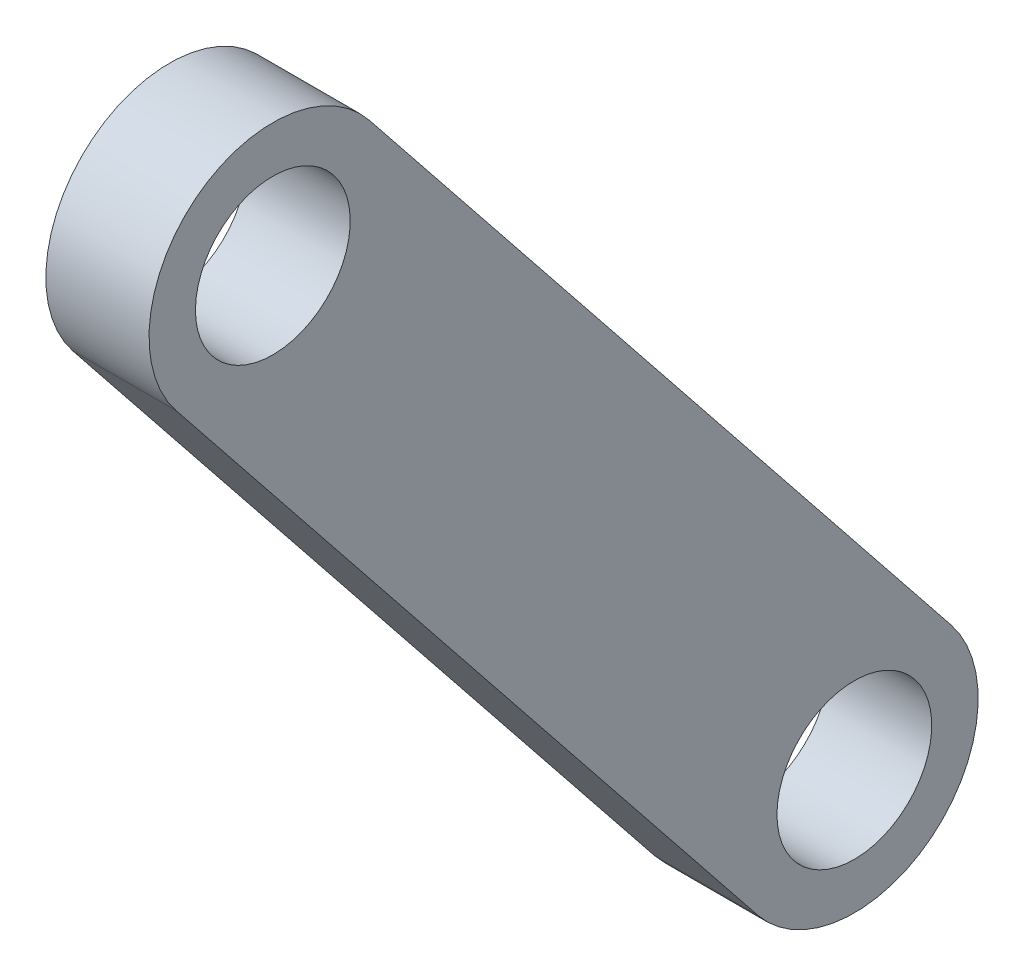
ISO-10303-21;
HEADER;
FILE_DESCRIPTION(('STEP AP214'),'2;1');
FILE_NAME('part.step','',(''),(''),'','','');
FILE_SCHEMA(('AUTOMOTIVE_DESIGN { 1 0 10303 214 1 1 1 1 }'));
ENDSEC;
DATA;
#1=APPLICATION_CONTEXT('core data for automotive mechanical design processes');
#2=APPLICATION_PROTOCOL_DEFINITION('international standard','automotive_design',2000,#1);
#3=PRODUCT_CONTEXT('',#1,'mechanical');
#4=PRODUCT('Part','Part','',(#3));
#5=PRODUCT_RELATED_PRODUCT_CATEGORY('part','',(#4));
#6=PRODUCT_DEFINITION_FORMATION('','',#4);
#7=PRODUCT_DEFINITION_CONTEXT('part definition',#1,'design');
#8=PRODUCT_DEFINITION('design','',#6,#7);
#9=PRODUCT_DEFINITION_SHAPE('','',#8);
#10=(LENGTH_UNIT() NAMED_UNIT(*) SI_UNIT(.MILLI.,.METRE.));
#11=(NAMED_UNIT(*) PLANE_ANGLE_UNIT() SI_UNIT($,.RADIAN.));
#12=(NAMED_UNIT(*) SI_UNIT($,.STERADIAN.) SOLID_ANGLE_UNIT());
#13=UNCERTAINTY_MEASURE_WITH_UNIT(LENGTH_MEASURE(1.E-05),#10,'distance_accuracy_value','');
#14=(GEOMETRIC_REPRESENTATION_CONTEXT(3) GLOBAL_UNCERTAINTY_ASSIGNED_CONTEXT((#13)) GLOBAL_UNIT_ASSIGNED_CONTEXT((#10,
#11,#12)) REPRESENTATION_CONTEXT('',''));
#15=CARTESIAN_POINT('',(0.,0.,0.));
#16=DIRECTION('',(0.,0.,1.));
#17=DIRECTION('',(1.,0.,0.));
#18=AXIS2_PLACEMENT_3D('',#15,#16,#17);
#19=CARTESIAN_POINT('',(2199.99999999987,5550.11623000931,-4431.25255969027));
#20=DIRECTION('',(1.,0.,0.));
#21=DIRECTION('',(0.,0.586791313624978,0.809738201059005));
#22=AXIS2_PLACEMENT_3D('',#19,#20,#21);
#23=PLANE('',#22);
#24=DIRECTION('',(0.,-0.781191492489702,-0.624291480048952));
#25=VECTOR('',#24,1.);
#26=CARTESIAN_POINT('',(2199.99999999987,5475.20125240349,-4337.50958059147));
#27=LINE('',#26,#25);
#28=CARTESIAN_POINT('',(2199.99999999987,5475.20125240346,-4337.50958059149));
#29=VERTEX_POINT('',#28);
#30=CARTESIAN_POINT('',(2199.99999999987,4769.94531848226,-4901.11693555354));
#31=VERTEX_POINT('',#30);
#32=EDGE_CURVE('E68',#29,#31,#27,.T.);
#33=ORIENTED_EDGE('',*,*,#32,.F.);
#34=CARTESIAN_POINT('',(2199.99999999987,5550.11623000931,-4431.25255969027));
#35=DIRECTION('',(1.,0.,0.));
#36=DIRECTION('',(0.,0.586791313624978,0.809738201059005));
#37=AXIS2_PLACEMENT_3D('',#34,#35,#36);
#38=CIRCLE('',#37,120.);
#39=CARTESIAN_POINT('',(2199.99999999987,5625.03120761519,-4524.99553878904));
#40=VERTEX_POINT('',#39);
#41=EDGE_CURVE('E59',#40,#29,#38,.T.);
#42=ORIENTED_EDGE('',*,*,#41,.F.);
#43=DIRECTION('',(0.,-0.781191492489703,-0.624291480048952));
#44=VECTOR('',#43,1.);
#45=CARTESIAN_POINT('',(2199.99999999987,5625.03120761519,-4524.99553878904));
#46=LINE('',#45,#44);
#47=CARTESIAN_POINT('',(2199.99999999987,4919.775273694,-5088.60289375107));
#48=VERTEX_POINT('',#47);
#49=EDGE_CURVE('E56',#40,#48,#46,.T.);
#50=ORIENTED_EDGE('',*,*,#49,.T.);
#51=CARTESIAN_POINT('',(2199.99999999987,4844.86029608813,-4994.8599146523));
#52=DIRECTION('',(1.,0.,0.));
#53=DIRECTION('',(0.,0.586791313624978,0.809738201059005));
#54=AXIS2_PLACEMENT_3D('',#51,#52,#53);
#55=CIRCLE('',#54,120.);
#56=EDGE_CURVE('E54',#31,#48,#55,.T.);
#57=ORIENTED_EDGE('',*,*,#56,.F.);
#58=EDGE_LOOP('',(#33,#42,#50,#57));
#59=FACE_BOUND('',#58,.T.);
#60=CARTESIAN_POINT('',(2199.99999999987,5550.11623000931,-4431.25255969027));
#61=DIRECTION('',(1.,0.,0.));
#62=DIRECTION('',(0.,0.586791313624978,0.809738201059005));
#63=AXIS2_PLACEMENT_3D('',#60,#61,#62);
#64=CIRCLE('',#63,75.0000000000001);
#65=CARTESIAN_POINT('',(2199.99999999987,5594.12557853119,-4370.52219461085));
#66=VERTEX_POINT('',#65);
#67=EDGE_CURVE('E78',#66,#66,#64,.T.);
#68=ORIENTED_EDGE('',*,*,#67,.T.);
#69=EDGE_LOOP('',(#68));
#70=FACE_BOUND('',#69,.T.);
#71=CARTESIAN_POINT('',(2199.99999999987,4844.86029608813,-4994.8599146523));
#72=DIRECTION('',(1.,0.,0.));
#73=DIRECTION('',(0.,0.586791313624978,0.809738201059005));
#74=AXIS2_PLACEMENT_3D('',#71,#72,#73);
#75=CIRCLE('',#74,75.0000000000072);
#76=CARTESIAN_POINT('',(2199.99999999987,4888.86964461001,-4934.12954957287));
#77=VERTEX_POINT('',#76);
#78=EDGE_CURVE('E19',#77,#77,#75,.T.);
#79=ORIENTED_EDGE('',*,*,#78,.T.);
#80=EDGE_LOOP('',(#79));
#81=FACE_BOUND('',#80,.T.);
#82=ADVANCED_FACE('F16',(#59,#70,#81),#23,.F.);
#83=CARTESIAN_POINT('',(2199.99999999987,4844.86029608813,-4994.8599146523));
#84=DIRECTION('',(1.,0.,0.));
#85=DIRECTION('',(0.,0.586791313624978,0.809738201059005));
#86=AXIS2_PLACEMENT_3D('',#83,#84,#85);
#87=CYLINDRICAL_SURFACE('',#86,75.0000000000072);
#88=CARTESIAN_POINT('',(2299.99999999987,4844.86029608813,-4994.8599146523));
#89=DIRECTION('',(1.,0.,0.));
#90=DIRECTION('',(0.,0.586791313624978,0.809738201059005));
#91=AXIS2_PLACEMENT_3D('',#88,#89,#90);
#92=CIRCLE('',#91,75.0000000000072);
#93=CARTESIAN_POINT('',(2299.99999999987,4888.86964461001,-4934.12954957287));
#94=VERTEX_POINT('',#93);
#95=EDGE_CURVE('E86',#94,#94,#92,.F.);
#96=ORIENTED_EDGE('',*,*,#95,.F.);
#97=EDGE_LOOP('',(#96));
#98=FACE_BOUND('',#97,.T.);
#99=ORIENTED_EDGE('',*,*,#78,.F.);
#100=EDGE_LOOP('',(#99));
#101=FACE_BOUND('',#100,.T.);
#102=ADVANCED_FACE('F96',(#98,#101),#87,.F.);
#103=CARTESIAN_POINT('',(2199.99999999987,5550.11623000931,-4431.25255969027));
#104=DIRECTION('',(1.,0.,0.));
#105=DIRECTION('',(0.,0.586791313624978,0.809738201059005));
#106=AXIS2_PLACEMENT_3D('',#103,#104,#105);
#107=CYLINDRICAL_SURFACE('',#106,75.0000000000001);
#108=CARTESIAN_POINT('',(2299.99999999987,5550.11623000931,-4431.25255969027));
#109=DIRECTION('',(1.,0.,0.));
#110=DIRECTION('',(0.,0.586791313624978,0.809738201059005));
#111=AXIS2_PLACEMENT_3D('',#108,#109,#110);
#112=CIRCLE('',#111,75.0000000000001);
#113=CARTESIAN_POINT('',(2299.99999999987,5594.12557853119,-4370.52219461085));
#114=VERTEX_POINT('',#113);
#115=EDGE_CURVE('E83',#114,#114,#112,.F.);
#116=ORIENTED_EDGE('',*,*,#115,.F.);
#117=EDGE_LOOP('',(#116));
#118=FACE_BOUND('',#117,.T.);
#119=ORIENTED_EDGE('',*,*,#67,.F.);
#120=EDGE_LOOP('',(#119));
#121=FACE_BOUND('',#120,.T.);
#122=ADVANCED_FACE('F98',(#118,#121),#107,.F.);
#123=CARTESIAN_POINT('',(2114.99999999987,-35.5179925257829,-8741.41708166616));
#124=DIRECTION('',(0.,-0.624291480048952,0.781191492489703));
#125=DIRECTION('',(0.000222778985371864,-0.78119147310425,-0.62429146455701));
#126=AXIS2_PLACEMENT_3D('',#123,#124,#125);
#127=PLANE('',#126);
#128=DIRECTION('',(0.,-0.781191492489702,-0.624291480048952));
#129=VECTOR('',#128,1.);
#130=CARTESIAN_POINT('',(2299.99999999987,5475.20125240344,-4337.50958059151));
#131=LINE('',#130,#129);
#132=CARTESIAN_POINT('',(2299.99999999987,5475.20125240346,-4337.50958059149));
#133=VERTEX_POINT('',#132);
#134=CARTESIAN_POINT('',(2299.99999999987,4769.94531848226,-4901.11693555354));
#135=VERTEX_POINT('',#134);
#136=EDGE_CURVE('E82',#133,#135,#131,.T.);
#137=ORIENTED_EDGE('',*,*,#136,.F.);
#138=DIRECTION('',(1.,0.,0.));
#139=VECTOR('',#138,1.);
#140=CARTESIAN_POINT('',(2114.99999999987,5475.20125240349,-4337.50958059147));
#141=LINE('',#140,#139);
#142=EDGE_CURVE('E89',#29,#133,#141,.T.);
#143=ORIENTED_EDGE('',*,*,#142,.F.);
#144=ORIENTED_EDGE('',*,*,#32,.T.);
#145=DIRECTION('',(1.,0.,0.));
#146=VECTOR('',#145,1.);
#147=CARTESIAN_POINT('',(2114.99999999987,4769.94531848226,-4901.11693555354));
#148=LINE('',#147,#146);
#149=EDGE_CURVE('E62',#135,#31,#148,.F.);
#150=ORIENTED_EDGE('',*,*,#149,.F.);
#151=EDGE_LOOP('',(#137,#143,#144,#150));
#152=FACE_BOUND('',#151,.T.);
#153=ADVANCED_FACE('F105',(#152),#127,.T.);
#154=CARTESIAN_POINT('',(2114.99999999987,4844.86029608813,-4994.8599146523));
#155=DIRECTION('',(1.,0.,0.));
#156=DIRECTION('',(0.,0.586791313624978,0.809738201059005));
#157=AXIS2_PLACEMENT_3D('',#154,#155,#156);
#158=CYLINDRICAL_SURFACE('',#157,120.);
#159=CARTESIAN_POINT('',(2299.99999999987,4844.86029608813,-4994.8599146523));
#160=DIRECTION('',(1.,0.,0.));
#161=DIRECTION('',(0.,0.586791313624978,0.809738201059005));
#162=AXIS2_PLACEMENT_3D('',#159,#160,#161);
#163=CIRCLE('',#162,120.);
#164=CARTESIAN_POINT('',(2299.99999999987,4919.775273694,-5088.60289375106));
#165=VERTEX_POINT('',#164);
#166=EDGE_CURVE('E80',#135,#165,#163,.T.);
#167=ORIENTED_EDGE('',*,*,#166,.F.);
#168=ORIENTED_EDGE('',*,*,#149,.T.);
#169=ORIENTED_EDGE('',*,*,#56,.T.);
#170=DIRECTION('',(1.,0.,0.));
#171=VECTOR('',#170,1.);
#172=CARTESIAN_POINT('',(2199.99999999987,4919.77527369401,-5088.60289375107));
#173=LINE('',#172,#171);
#174=EDGE_CURVE('E61',#48,#165,#173,.T.);
#175=ORIENTED_EDGE('',*,*,#174,.T.);
#176=EDGE_LOOP('',(#167,#168,#169,#175));
#177=FACE_BOUND('',#176,.T.);
#178=ADVANCED_FACE('F67',(#177),#158,.T.);
#179=CARTESIAN_POINT('',(2114.99999999987,114.311962685966,-8928.90303986369));
#180=DIRECTION('',(0.,-0.624291480048952,0.781191492489703));
#181=DIRECTION('',(0.000222778985371864,-0.781191473104249,-0.62429146455701));
#182=AXIS2_PLACEMENT_3D('',#179,#180,#181);
#183=PLANE('',#182);
#184=DIRECTION('',(0.,0.781191492489703,0.624291480048952));
#185=VECTOR('',#184,1.);
#186=CARTESIAN_POINT('',(2299.99999999987,4919.775273694,-5088.60289375106));
#187=LINE('',#186,#185);
#188=CARTESIAN_POINT('',(2299.99999999987,5625.03120761519,-4524.99553878903));
#189=VERTEX_POINT('',#188);
#190=EDGE_CURVE('E25',#165,#189,#187,.T.);
#191=ORIENTED_EDGE('',*,*,#190,.F.);
#192=ORIENTED_EDGE('',*,*,#174,.F.);
#193=ORIENTED_EDGE('',*,*,#49,.F.);
#194=DIRECTION('',(1.,0.,0.));
#195=VECTOR('',#194,1.);
#196=CARTESIAN_POINT('',(2114.99999999987,5625.03120761519,-4524.99553878903));
#197=LINE('',#196,#195);
#198=EDGE_CURVE('E34',#189,#40,#197,.F.);
#199=ORIENTED_EDGE('',*,*,#198,.F.);
#200=EDGE_LOOP('',(#191,#192,#193,#199));
#201=FACE_BOUND('',#200,.T.);
#202=ADVANCED_FACE('F70',(#201),#183,.F.);
#203=CARTESIAN_POINT('',(2114.99999999987,5550.11623000931,-4431.25255969027));
#204=DIRECTION('',(1.,0.,0.));
#205=DIRECTION('',(0.,0.586791313624978,0.809738201059005));
#206=AXIS2_PLACEMENT_3D('',#203,#204,#205);
#207=CYLINDRICAL_SURFACE('',#206,120.);
#208=ORIENTED_EDGE('',*,*,#142,.T.);
#209=CARTESIAN_POINT('',(2299.99999999987,5550.11623000931,-4431.25255969027));
#210=DIRECTION('',(1.,0.,0.));
#211=DIRECTION('',(0.,0.586791313624978,0.809738201059005));
#212=AXIS2_PLACEMENT_3D('',#209,#210,#211);
#213=CIRCLE('',#212,120.);
#214=EDGE_CURVE('E10',#189,#133,#213,.T.);
#215=ORIENTED_EDGE('',*,*,#214,.F.);
#216=ORIENTED_EDGE('',*,*,#198,.T.);
#217=ORIENTED_EDGE('',*,*,#41,.T.);
#218=EDGE_LOOP('',(#208,#215,#216,#217));
#219=FACE_BOUND('',#218,.T.);
#220=ADVANCED_FACE('F111',(#219),#207,.T.);
#221=CARTESIAN_POINT('',(2299.99999999987,5550.11623000931,-4431.25255969027));
#222=DIRECTION('',(1.,0.,0.));
#223=DIRECTION('',(0.,0.586791313624978,0.809738201059005));
#224=AXIS2_PLACEMENT_3D('',#221,#222,#223);
#225=PLANE('',#224);
#226=ORIENTED_EDGE('',*,*,#214,.T.);
#227=ORIENTED_EDGE('',*,*,#136,.T.);
#228=ORIENTED_EDGE('',*,*,#166,.T.);
#229=ORIENTED_EDGE('',*,*,#190,.T.);
#230=EDGE_LOOP('',(#226,#227,#228,#229));
#231=FACE_BOUND('',#230,.T.);
#232=ORIENTED_EDGE('',*,*,#115,.T.);
#233=EDGE_LOOP('',(#232));
#234=FACE_BOUND('',#233,.T.);
#235=ORIENTED_EDGE('',*,*,#95,.T.);
#236=EDGE_LOOP('',(#235));
#237=FACE_BOUND('',#236,.T.);
#238=ADVANCED_FACE('F109',(#231,#234,#237),#225,.T.);
#239=CLOSED_SHELL('',(#82,#102,#122,#153,#178,#202,#220,#238));
#240=MANIFOLD_SOLID_BREP('B1',#239);
#241=ADVANCED_BREP_SHAPE_REPRESENTATION('',(#18,#240),#14);
#242=SHAPE_DEFINITION_REPRESENTATION(#9,#241);
ENDSEC;
END-ISO-10303-21;
